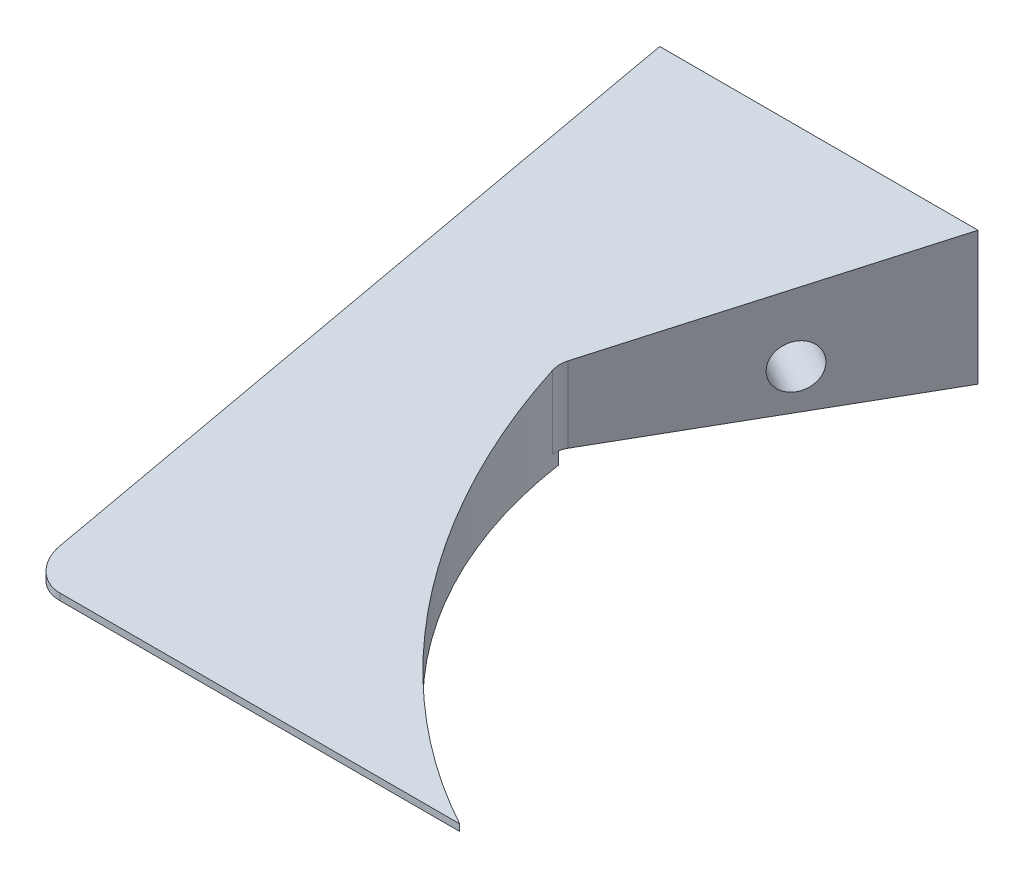
ISO-10303-21;
HEADER;
FILE_DESCRIPTION(('STEP AP214'),'2;1');
FILE_NAME('part.step','',(''),(''),'','','');
FILE_SCHEMA(('AUTOMOTIVE_DESIGN { 1 0 10303 214 1 1 1 1 }'));
ENDSEC;
DATA;
#1=APPLICATION_CONTEXT('core data for automotive mechanical design processes');
#2=APPLICATION_PROTOCOL_DEFINITION('international standard','automotive_design',2000,#1);
#3=PRODUCT_CONTEXT('',#1,'mechanical');
#4=PRODUCT('Part','Part','',(#3));
#5=PRODUCT_RELATED_PRODUCT_CATEGORY('part','',(#4));
#6=PRODUCT_DEFINITION_FORMATION('','',#4);
#7=PRODUCT_DEFINITION_CONTEXT('part definition',#1,'design');
#8=PRODUCT_DEFINITION('design','',#6,#7);
#9=PRODUCT_DEFINITION_SHAPE('','',#8);
#10=(LENGTH_UNIT() NAMED_UNIT(*) SI_UNIT(.MILLI.,.METRE.));
#11=(NAMED_UNIT(*) PLANE_ANGLE_UNIT() SI_UNIT($,.RADIAN.));
#12=(NAMED_UNIT(*) SI_UNIT($,.STERADIAN.) SOLID_ANGLE_UNIT());
#13=UNCERTAINTY_MEASURE_WITH_UNIT(LENGTH_MEASURE(1.E-05),#10,'distance_accuracy_value','');
#14=(GEOMETRIC_REPRESENTATION_CONTEXT(3) GLOBAL_UNCERTAINTY_ASSIGNED_CONTEXT((#13)) GLOBAL_UNIT_ASSIGNED_CONTEXT((#10,
#11,#12)) REPRESENTATION_CONTEXT('',''));
#15=CARTESIAN_POINT('',(0.,0.,0.));
#16=DIRECTION('',(0.,0.,1.));
#17=DIRECTION('',(1.,0.,0.));
#18=AXIS2_PLACEMENT_3D('',#15,#16,#17);
#19=CARTESIAN_POINT('',(0.,0.,95.));
#20=DIRECTION('',(0.,0.,1.));
#21=DIRECTION('',(1.,0.,0.));
#22=AXIS2_PLACEMENT_3D('',#19,#20,#21);
#23=PLANE('',#22);
#24=DIRECTION('',(1.,0.,0.));
#25=VECTOR('',#24,1.);
#26=CARTESIAN_POINT('',(-242.490187384685,-10.,95.));
#27=LINE('',#26,#25);
#28=CARTESIAN_POINT('',(-60.,-10.,95.));
#29=VERTEX_POINT('',#28);
#30=CARTESIAN_POINT('',(0.,-10.,95.));
#31=VERTEX_POINT('',#30);
#32=EDGE_CURVE('E196',#29,#31,#27,.T.);
#33=ORIENTED_EDGE('',*,*,#32,.F.);
#34=DIRECTION('',(0.,-1.,0.));
#35=VECTOR('',#34,1.);
#36=CARTESIAN_POINT('',(-60.,-11.,95.));
#37=LINE('',#36,#35);
#38=CARTESIAN_POINT('',(-60.,-11.,95.));
#39=VERTEX_POINT('',#38);
#40=EDGE_CURVE('E154',#29,#39,#37,.T.);
#41=ORIENTED_EDGE('',*,*,#40,.T.);
#42=DIRECTION('',(1.,0.,0.));
#43=VECTOR('',#42,1.);
#44=CARTESIAN_POINT('',(-65.,-11.,95.));
#45=LINE('',#44,#43);
#46=CARTESIAN_POINT('',(0.,-11.,95.));
#47=VERTEX_POINT('',#46);
#48=EDGE_CURVE('E152',#39,#47,#45,.T.);
#49=ORIENTED_EDGE('',*,*,#48,.T.);
#50=DIRECTION('',(0.,1.,0.));
#51=VECTOR('',#50,1.);
#52=CARTESIAN_POINT('',(0.,-11.001,95.));
#53=LINE('',#52,#51);
#54=EDGE_CURVE('E207',#47,#31,#53,.T.);
#55=ORIENTED_EDGE('',*,*,#54,.T.);
#56=EDGE_LOOP('',(#33,#41,#49,#55));
#57=FACE_BOUND('',#56,.T.);
#58=ADVANCED_FACE('F50',(#57),#23,.T.);
#59=CARTESIAN_POINT('',(-65.,11.,95.));
#60=DIRECTION('',(1.,0.,0.));
#61=DIRECTION('',(0.,0.,-1.));
#62=AXIS2_PLACEMENT_3D('',#59,#60,#61);
#63=PLANE('',#62);
#64=CARTESIAN_POINT('',(-65.,-3.,20.));
#65=DIRECTION('',(-1.,0.,0.));
#66=DIRECTION('',(0.,0.,1.));
#67=AXIS2_PLACEMENT_3D('',#64,#65,#66);
#68=CIRCLE('',#67,3.28999849999999);
#69=CARTESIAN_POINT('',(-65.,-3.,23.2899985));
#70=VERTEX_POINT('',#69);
#71=EDGE_CURVE('E226',#70,#70,#68,.T.);
#72=ORIENTED_EDGE('',*,*,#71,.F.);
#73=EDGE_LOOP('',(#72));
#74=FACE_BOUND('',#73,.T.);
#75=DIRECTION('',(0.,-1.,0.));
#76=VECTOR('',#75,1.);
#77=CARTESIAN_POINT('',(-65.,11.,0.));
#78=LINE('',#77,#76);
#79=CARTESIAN_POINT('',(-65.,11.,0.));
#80=VERTEX_POINT('',#79);
#81=CARTESIAN_POINT('',(-65.,-9.,0.));
#82=VERTEX_POINT('',#81);
#83=EDGE_CURVE('E156',#80,#82,#78,.T.);
#84=ORIENTED_EDGE('',*,*,#83,.T.);
#85=DIRECTION('',(0.,0.,-1.));
#86=VECTOR('',#85,1.);
#87=CARTESIAN_POINT('',(-65.,-9.,40.));
#88=LINE('',#87,#86);
#89=CARTESIAN_POINT('',(-65.,-9.,40.));
#90=VERTEX_POINT('',#89);
#91=EDGE_CURVE('E145',#90,#82,#88,.T.);
#92=ORIENTED_EDGE('',*,*,#91,.F.);
#93=DIRECTION('',(0.,1.,0.));
#94=VECTOR('',#93,1.);
#95=CARTESIAN_POINT('',(-65.,-9.,40.));
#96=LINE('',#95,#94);
#97=CARTESIAN_POINT('',(-65.,-11.,40.));
#98=VERTEX_POINT('',#97);
#99=EDGE_CURVE('E130',#98,#90,#96,.T.);
#100=ORIENTED_EDGE('',*,*,#99,.F.);
#101=DIRECTION('',(0.,0.,-1.));
#102=VECTOR('',#101,1.);
#103=CARTESIAN_POINT('',(-65.,-11.,95.));
#104=LINE('',#103,#102);
#105=CARTESIAN_POINT('',(-65.,-11.,90.));
#106=VERTEX_POINT('',#105);
#107=EDGE_CURVE('E143',#106,#98,#104,.T.);
#108=ORIENTED_EDGE('',*,*,#107,.F.);
#109=DIRECTION('',(0.,-1.,0.));
#110=VECTOR('',#109,1.);
#111=CARTESIAN_POINT('',(-65.,-10.,90.));
#112=LINE('',#111,#110);
#113=CARTESIAN_POINT('',(-65.,-8.89473684210525,90.));
#114=VERTEX_POINT('',#113);
#115=EDGE_CURVE('E164',#106,#114,#112,.F.);
#116=ORIENTED_EDGE('',*,*,#115,.T.);
#117=DIRECTION('',(0.,-0.215842043801446,0.976428293387494));
#118=VECTOR('',#117,1.);
#119=CARTESIAN_POINT('',(-65.,-9.0216564546799,90.5741601521234));
#120=LINE('',#119,#118);
#121=EDGE_CURVE('E198',#80,#114,#120,.T.);
#122=ORIENTED_EDGE('',*,*,#121,.F.);
#123=EDGE_LOOP('',(#84,#92,#100,#108,#116,#122));
#124=FACE_BOUND('',#123,.T.);
#125=ADVANCED_FACE('F142',(#74,#124),#63,.F.);
#126=CARTESIAN_POINT('',(32.4564469149875,-11.001,29.0860151639546));
#127=DIRECTION('',(0.,1.,0.));
#128=DIRECTION('',(0.,0.,1.));
#129=AXIS2_PLACEMENT_3D('',#126,#127,#128);
#130=CYLINDRICAL_SURFACE('',#129,73.4715886810121);
#131=CARTESIAN_POINT('',(32.4564469149875,-9.,29.0860151639546));
#132=DIRECTION('',(0.,1.,0.));
#133=DIRECTION('',(0.,0.,1.));
#134=AXIS2_PLACEMENT_3D('',#131,#132,#133);
#135=CIRCLE('',#134,73.4715886810121);
#136=CARTESIAN_POINT('',(-40.2,-9.,40.));
#137=VERTEX_POINT('',#136);
#138=CARTESIAN_POINT('',(-40.0319127741317,-9.,41.0656667821237));
#139=VERTEX_POINT('',#138);
#140=EDGE_CURVE('E64',#137,#139,#135,.T.);
#141=ORIENTED_EDGE('',*,*,#140,.T.);
#142=DIRECTION('',(0.,1.,0.));
#143=VECTOR('',#142,1.);
#144=CARTESIAN_POINT('',(-40.0319127741317,-11.001,41.0656667821237));
#145=LINE('',#144,#143);
#146=CARTESIAN_POINT('',(-40.0319127741317,1.92232629026739,41.0656667821237));
#147=VERTEX_POINT('',#146);
#148=EDGE_CURVE('E169',#139,#147,#145,.T.);
#149=ORIENTED_EDGE('',*,*,#148,.T.);
#150=CARTESIAN_POINT('',(32.4564469149875,4.57045980586267,29.0860151639546));
#151=DIRECTION('',(0.,0.976428293387494,0.215842043801446));
#152=DIRECTION('',(0.,0.215842043801446,-0.976428293387494));
#153=AXIS2_PLACEMENT_3D('',#150,#151,#152);
#154=ELLIPSE('',#153,75.2452475809762,73.4715886810121);
#155=EDGE_CURVE('E191',#147,#31,#154,.T.);
#156=ORIENTED_EDGE('',*,*,#155,.T.);
#157=ORIENTED_EDGE('',*,*,#54,.F.);
#158=CARTESIAN_POINT('',(32.4564469149875,-11.,29.0860151639546));
#159=DIRECTION('',(0.,1.,0.));
#160=DIRECTION('',(0.,0.,1.));
#161=AXIS2_PLACEMENT_3D('',#158,#159,#160);
#162=CIRCLE('',#161,73.4715886810121);
#163=CARTESIAN_POINT('',(-40.2,-11.,40.));
#164=VERTEX_POINT('',#163);
#165=EDGE_CURVE('E200',#164,#47,#162,.T.);
#166=ORIENTED_EDGE('',*,*,#165,.F.);
#167=DIRECTION('',(0.,1.,0.));
#168=VECTOR('',#167,1.);
#169=CARTESIAN_POINT('',(-40.2,-11.001,40.));
#170=LINE('',#169,#168);
#171=EDGE_CURVE('E131',#164,#137,#170,.T.);
#172=ORIENTED_EDGE('',*,*,#171,.T.);
#173=EDGE_LOOP('',(#141,#149,#156,#157,#166,#172));
#174=FACE_BOUND('',#173,.T.);
#175=ADVANCED_FACE('F189',(#174),#130,.F.);
#176=CARTESIAN_POINT('',(-40.2,-11.001,40.));
#177=DIRECTION('',(0.867374440844356,0.,0.497656085434449));
#178=DIRECTION('',(0.497656085434449,0.,-0.867374440844356));
#179=AXIS2_PLACEMENT_3D('',#176,#177,#178);
#180=PLANE('',#179);
#181=DIRECTION('',(-0.48875328158422,-0.188305357885905,0.85185757138862));
#182=VECTOR('',#181,1.);
#183=CARTESIAN_POINT('',(-41.4110770560014,1.69129470150616,42.1108096836626));
#184=LINE('',#183,#182);
#185=CARTESIAN_POINT('',(-17.25,11.,0.));
#186=VERTEX_POINT('',#185);
#187=CARTESIAN_POINT('',(-39.6741834111387,2.36047973151862,39.0835440717015));
#188=VERTEX_POINT('',#187);
#189=EDGE_CURVE('E151',#186,#188,#184,.T.);
#190=ORIENTED_EDGE('',*,*,#189,.T.);
#191=DIRECTION('',(0.,-1.,0.));
#192=VECTOR('',#191,1.);
#193=CARTESIAN_POINT('',(-39.6741834111387,-9.,39.0835440717015));
#194=LINE('',#193,#192);
#195=CARTESIAN_POINT('',(-39.6741834111387,-9.,39.0835440717015));
#196=VERTEX_POINT('',#195);
#197=EDGE_CURVE('E172',#188,#196,#194,.T.);
#198=ORIENTED_EDGE('',*,*,#197,.T.);
#199=DIRECTION('',(-0.497656085434449,0.,0.867374440844356));
#200=VECTOR('',#199,1.);
#201=CARTESIAN_POINT('',(-40.2,-9.,40.));
#202=LINE('',#201,#200);
#203=CARTESIAN_POINT('',(-17.25,-9.,0.));
#204=VERTEX_POINT('',#203);
#205=EDGE_CURVE('E179',#204,#196,#202,.T.);
#206=ORIENTED_EDGE('',*,*,#205,.F.);
#207=DIRECTION('',(0.,1.,0.));
#208=VECTOR('',#207,1.);
#209=CARTESIAN_POINT('',(-17.25,-11.001,0.));
#210=LINE('',#209,#208);
#211=EDGE_CURVE('E209',#204,#186,#210,.T.);
#212=ORIENTED_EDGE('',*,*,#211,.T.);
#213=EDGE_LOOP('',(#190,#198,#206,#212));
#214=FACE_BOUND('',#213,.T.);
#215=CARTESIAN_POINT('',(-27.203121708689,-3.,17.3474888168871));
#216=DIRECTION('',(0.867374440844357,0.,0.497656085434449));
#217=DIRECTION('',(0.497656085434449,0.,-0.867374440844357));
#218=AXIS2_PLACEMENT_3D('',#215,#216,#217);
#219=CIRCLE('',#218,3.28999849999999);
#220=CARTESIAN_POINT('',(-25.5658339340938,-3.,14.4938282075709));
#221=VERTEX_POINT('',#220);
#222=EDGE_CURVE('E185',#221,#221,#219,.T.);
#223=ORIENTED_EDGE('',*,*,#222,.F.);
#224=EDGE_LOOP('',(#223));
#225=FACE_BOUND('',#224,.T.);
#226=ADVANCED_FACE('F177',(#214,#225),#180,.T.);
#227=CARTESIAN_POINT('',(-65.,-11.,95.));
#228=DIRECTION('',(0.,1.,0.));
#229=DIRECTION('',(0.,0.,1.));
#230=AXIS2_PLACEMENT_3D('',#227,#228,#229);
#231=PLANE('',#230);
#232=ORIENTED_EDGE('',*,*,#107,.T.);
#233=DIRECTION('',(-1.,0.,0.));
#234=VECTOR('',#233,1.);
#235=CARTESIAN_POINT('',(-65.,-11.,40.));
#236=LINE('',#235,#234);
#237=EDGE_CURVE('E126',#164,#98,#236,.T.);
#238=ORIENTED_EDGE('',*,*,#237,.F.);
#239=ORIENTED_EDGE('',*,*,#165,.T.);
#240=ORIENTED_EDGE('',*,*,#48,.F.);
#241=CARTESIAN_POINT('',(-60.,-11.,90.));
#242=DIRECTION('',(0.,1.,0.));
#243=DIRECTION('',(0.,0.,1.));
#244=AXIS2_PLACEMENT_3D('',#241,#242,#243);
#245=CIRCLE('',#244,5.);
#246=EDGE_CURVE('E150',#39,#106,#245,.F.);
#247=ORIENTED_EDGE('',*,*,#246,.T.);
#248=EDGE_LOOP('',(#232,#238,#239,#240,#247));
#249=FACE_BOUND('',#248,.T.);
#250=ADVANCED_FACE('F148',(#249),#231,.F.);
#251=CARTESIAN_POINT('',(0.,0.,0.));
#252=DIRECTION('',(0.,0.,1.));
#253=DIRECTION('',(1.,0.,0.));
#254=AXIS2_PLACEMENT_3D('',#251,#252,#253);
#255=PLANE('',#254);
#256=ORIENTED_EDGE('',*,*,#211,.F.);
#257=DIRECTION('',(1.,0.,0.));
#258=VECTOR('',#257,1.);
#259=CARTESIAN_POINT('',(-17.25,-9.,0.));
#260=LINE('',#259,#258);
#261=EDGE_CURVE('E136',#82,#204,#260,.T.);
#262=ORIENTED_EDGE('',*,*,#261,.F.);
#263=ORIENTED_EDGE('',*,*,#83,.F.);
#264=DIRECTION('',(-1.,0.,0.));
#265=VECTOR('',#264,1.);
#266=CARTESIAN_POINT('',(-65.,11.,0.));
#267=LINE('',#266,#265);
#268=EDGE_CURVE('E211',#186,#80,#267,.T.);
#269=ORIENTED_EDGE('',*,*,#268,.F.);
#270=EDGE_LOOP('',(#256,#262,#263,#269));
#271=FACE_BOUND('',#270,.T.);
#272=ADVANCED_FACE('F216',(#271),#255,.F.);
#273=CARTESIAN_POINT('',(-242.490187384685,11.,0.));
#274=DIRECTION('',(0.,0.976428293387494,0.215842043801446));
#275=DIRECTION('',(0.,-0.215842043801446,0.976428293387494));
#276=AXIS2_PLACEMENT_3D('',#273,#274,#275);
#277=PLANE('',#276);
#278=ORIENTED_EDGE('',*,*,#121,.T.);
#279=CARTESIAN_POINT('',(-60.,-8.89473684210525,90.));
#280=DIRECTION('',(0.,0.976428293387494,0.215842043801446));
#281=DIRECTION('',(0.,0.215842043801446,-0.976428293387494));
#282=AXIS2_PLACEMENT_3D('',#279,#280,#281);
#283=ELLIPSE('',#282,5.12070372587591,5.);
#284=EDGE_CURVE('E166',#114,#29,#283,.T.);
#285=ORIENTED_EDGE('',*,*,#284,.T.);
#286=ORIENTED_EDGE('',*,*,#32,.T.);
#287=ORIENTED_EDGE('',*,*,#155,.F.);
#288=CARTESIAN_POINT('',(-37.0720600886057,2.03045516959893,40.5765123280049));
#289=DIRECTION('',(0.,0.976428293387494,0.215842043801446));
#290=DIRECTION('',(0.,0.215842043801446,-0.976428293387494));
#291=AXIS2_PLACEMENT_3D('',#288,#289,#290);
#292=ELLIPSE('',#291,3.07242223552555,3.);
#293=EDGE_CURVE('E58',#147,#188,#292,.F.);
#294=ORIENTED_EDGE('',*,*,#293,.T.);
#295=ORIENTED_EDGE('',*,*,#189,.F.);
#296=ORIENTED_EDGE('',*,*,#268,.T.);
#297=EDGE_LOOP('',(#278,#285,#286,#287,#294,#295,#296));
#298=FACE_BOUND('',#297,.T.);
#299=ADVANCED_FACE('F194',(#298),#277,.T.);
#300=CARTESIAN_POINT('',(-55.,-3.,20.));
#301=DIRECTION('',(-1.,0.,0.));
#302=DIRECTION('',(0.,0.,1.));
#303=AXIS2_PLACEMENT_3D('',#300,#301,#302);
#304=CONICAL_SURFACE('',#303,3.28999849999999,1.02974425867665);
#305=CARTESIAN_POINT('',(-53.0231694646903,-3.,20.));
#306=VERTEX_POINT('',#305);
#307=VERTEX_LOOP('',#306);
#308=FACE_BOUND('',#307,.T.);
#309=CARTESIAN_POINT('',(-55.,-3.,20.));
#310=DIRECTION('',(-1.,0.,0.));
#311=DIRECTION('',(0.,0.,1.));
#312=AXIS2_PLACEMENT_3D('',#309,#310,#311);
#313=CIRCLE('',#312,3.28999849999999);
#314=CARTESIAN_POINT('',(-55.,-3.,23.2899985));
#315=VERTEX_POINT('',#314);
#316=EDGE_CURVE('E202',#315,#315,#313,.T.);
#317=ORIENTED_EDGE('',*,*,#316,.T.);
#318=EDGE_LOOP('',(#317));
#319=FACE_BOUND('',#318,.T.);
#320=ADVANCED_FACE('F231',(#308,#319),#304,.F.);
#321=CARTESIAN_POINT('',(-65.,-3.,20.));
#322=DIRECTION('',(-1.,0.,0.));
#323=DIRECTION('',(0.,0.,1.));
#324=AXIS2_PLACEMENT_3D('',#321,#322,#323);
#325=CYLINDRICAL_SURFACE('',#324,3.28999849999999);
#326=ORIENTED_EDGE('',*,*,#316,.F.);
#327=EDGE_LOOP('',(#326));
#328=FACE_BOUND('',#327,.T.);
#329=ORIENTED_EDGE('',*,*,#71,.T.);
#330=EDGE_LOOP('',(#329));
#331=FACE_BOUND('',#330,.T.);
#332=ADVANCED_FACE('F233',(#328,#331),#325,.F.);
#333=CARTESIAN_POINT('',(-35.8768661171326,-3.,12.3709279625426));
#334=DIRECTION('',(0.867374440844357,0.,0.497656085434449));
#335=DIRECTION('',(0.497656085434449,0.,-0.867374440844357));
#336=AXIS2_PLACEMENT_3D('',#333,#334,#335);
#337=CONICAL_SURFACE('',#336,3.28999849999999,1.02974425867665);
#338=CARTESIAN_POINT('',(-37.5915183973409,-3.,11.3871462167731));
#339=VERTEX_POINT('',#338);
#340=VERTEX_LOOP('',#339);
#341=FACE_BOUND('',#340,.T.);
#342=CARTESIAN_POINT('',(-35.8768661171326,-3.,12.3709279625426));
#343=DIRECTION('',(0.867374440844357,0.,0.497656085434449));
#344=DIRECTION('',(0.497656085434449,0.,-0.867374440844357));
#345=AXIS2_PLACEMENT_3D('',#342,#343,#344);
#346=CIRCLE('',#345,3.28999849999999);
#347=CARTESIAN_POINT('',(-34.2395783425373,-3.,9.51726735322637));
#348=VERTEX_POINT('',#347);
#349=EDGE_CURVE('E223',#348,#348,#346,.T.);
#350=ORIENTED_EDGE('',*,*,#349,.T.);
#351=EDGE_LOOP('',(#350));
#352=FACE_BOUND('',#351,.T.);
#353=ADVANCED_FACE('F236',(#341,#352),#337,.F.);
#354=CARTESIAN_POINT('',(-27.203121708689,-3.,17.3474888168871));
#355=DIRECTION('',(0.867374440844357,0.,0.497656085434449));
#356=DIRECTION('',(0.497656085434449,0.,-0.867374440844357));
#357=AXIS2_PLACEMENT_3D('',#354,#355,#356);
#358=CYLINDRICAL_SURFACE('',#357,3.28999849999999);
#359=ORIENTED_EDGE('',*,*,#349,.F.);
#360=EDGE_LOOP('',(#359));
#361=FACE_BOUND('',#360,.T.);
#362=ORIENTED_EDGE('',*,*,#222,.T.);
#363=EDGE_LOOP('',(#362));
#364=FACE_BOUND('',#363,.T.);
#365=ADVANCED_FACE('F253',(#361,#364),#358,.F.);
#366=CARTESIAN_POINT('',(-60.,0.,90.));
#367=DIRECTION('',(0.,1.,0.));
#368=DIRECTION('',(0.,0.,1.));
#369=AXIS2_PLACEMENT_3D('',#366,#367,#368);
#370=CYLINDRICAL_SURFACE('',#369,5.);
#371=ORIENTED_EDGE('',*,*,#284,.F.);
#372=ORIENTED_EDGE('',*,*,#115,.F.);
#373=ORIENTED_EDGE('',*,*,#246,.F.);
#374=ORIENTED_EDGE('',*,*,#40,.F.);
#375=EDGE_LOOP('',(#371,#372,#373,#374));
#376=FACE_BOUND('',#375,.T.);
#377=ADVANCED_FACE('F251',(#376),#370,.T.);
#378=CARTESIAN_POINT('',(-17.25,-9.,40.));
#379=DIRECTION('',(0.,1.,0.));
#380=DIRECTION('',(0.,0.,1.));
#381=AXIS2_PLACEMENT_3D('',#378,#379,#380);
#382=PLANE('',#381);
#383=ORIENTED_EDGE('',*,*,#205,.T.);
#384=CARTESIAN_POINT('',(-37.0720600886057,-9.,40.5765123280049));
#385=DIRECTION('',(0.,1.,0.));
#386=DIRECTION('',(0.,0.,1.));
#387=AXIS2_PLACEMENT_3D('',#384,#385,#386);
#388=CIRCLE('',#387,3.);
#389=EDGE_CURVE('E13',#196,#139,#388,.T.);
#390=ORIENTED_EDGE('',*,*,#389,.T.);
#391=ORIENTED_EDGE('',*,*,#140,.F.);
#392=DIRECTION('',(1.,0.,0.));
#393=VECTOR('',#392,1.);
#394=CARTESIAN_POINT('',(-17.25,-9.,40.));
#395=LINE('',#394,#393);
#396=EDGE_CURVE('E146',#90,#137,#395,.T.);
#397=ORIENTED_EDGE('',*,*,#396,.F.);
#398=ORIENTED_EDGE('',*,*,#91,.T.);
#399=ORIENTED_EDGE('',*,*,#261,.T.);
#400=EDGE_LOOP('',(#383,#390,#391,#397,#398,#399));
#401=FACE_BOUND('',#400,.T.);
#402=ADVANCED_FACE('F183',(#401),#382,.F.);
#403=CARTESIAN_POINT('',(0.,0.,40.));
#404=DIRECTION('',(0.,0.,1.));
#405=DIRECTION('',(1.,0.,0.));
#406=AXIS2_PLACEMENT_3D('',#403,#404,#405);
#407=PLANE('',#406);
#408=ORIENTED_EDGE('',*,*,#171,.F.);
#409=ORIENTED_EDGE('',*,*,#237,.T.);
#410=ORIENTED_EDGE('',*,*,#99,.T.);
#411=ORIENTED_EDGE('',*,*,#396,.T.);
#412=EDGE_LOOP('',(#408,#409,#410,#411));
#413=FACE_BOUND('',#412,.T.);
#414=ADVANCED_FACE('F128',(#413),#407,.F.);
#415=CARTESIAN_POINT('',(-37.0720600886057,-11.001,40.5765123280049));
#416=DIRECTION('',(0.,1.,0.));
#417=DIRECTION('',(0.,0.,1.));
#418=AXIS2_PLACEMENT_3D('',#415,#416,#417);
#419=CYLINDRICAL_SURFACE('',#418,3.);
#420=ORIENTED_EDGE('',*,*,#389,.F.);
#421=ORIENTED_EDGE('',*,*,#197,.F.);
#422=ORIENTED_EDGE('',*,*,#293,.F.);
#423=ORIENTED_EDGE('',*,*,#148,.F.);
#424=EDGE_LOOP('',(#420,#421,#422,#423));
#425=FACE_BOUND('',#424,.T.);
#426=ADVANCED_FACE('F52',(#425),#419,.F.);
#427=CLOSED_SHELL('',(#58,#125,#175,#226,#250,#272,#299,#320,#332,#353,#365,#377,#402,#414,#426));
#428=MANIFOLD_SOLID_BREP('B2',#427);
#429=ADVANCED_BREP_SHAPE_REPRESENTATION('',(#18,#428),#14);
#430=SHAPE_DEFINITION_REPRESENTATION(#9,#429);
ENDSEC;
END-ISO-10303-21;
